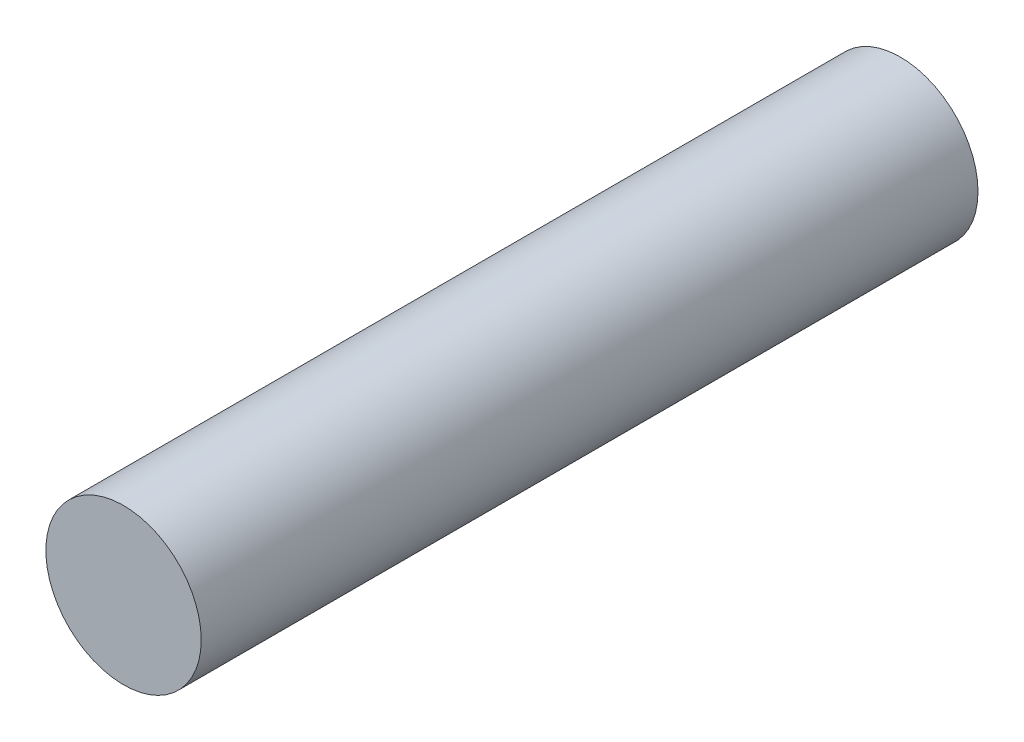
ISO-10303-21;
HEADER;
FILE_DESCRIPTION(('STEP AP214'),'2;1');
FILE_NAME('part.step','',(''),(''),'','','');
FILE_SCHEMA(('AUTOMOTIVE_DESIGN { 1 0 10303 214 1 1 1 1 }'));
ENDSEC;
DATA;
#1=APPLICATION_CONTEXT('core data for automotive mechanical design processes');
#2=APPLICATION_PROTOCOL_DEFINITION('international standard','automotive_design',2000,#1);
#3=PRODUCT_CONTEXT('',#1,'mechanical');
#4=PRODUCT('Part','Part','',(#3));
#5=PRODUCT_RELATED_PRODUCT_CATEGORY('part','',(#4));
#6=PRODUCT_DEFINITION_FORMATION('','',#4);
#7=PRODUCT_DEFINITION_CONTEXT('part definition',#1,'design');
#8=PRODUCT_DEFINITION('design','',#6,#7);
#9=PRODUCT_DEFINITION_SHAPE('','',#8);
#10=(LENGTH_UNIT() NAMED_UNIT(*) SI_UNIT(.MILLI.,.METRE.));
#11=(NAMED_UNIT(*) PLANE_ANGLE_UNIT() SI_UNIT($,.RADIAN.));
#12=(NAMED_UNIT(*) SI_UNIT($,.STERADIAN.) SOLID_ANGLE_UNIT());
#13=UNCERTAINTY_MEASURE_WITH_UNIT(LENGTH_MEASURE(1.E-05),#10,'distance_accuracy_value','');
#14=(GEOMETRIC_REPRESENTATION_CONTEXT(3) GLOBAL_UNCERTAINTY_ASSIGNED_CONTEXT((#13)) GLOBAL_UNIT_ASSIGNED_CONTEXT((#10,
#11,#12)) REPRESENTATION_CONTEXT('',''));
#15=CARTESIAN_POINT('',(0.,0.,0.));
#16=DIRECTION('',(0.,0.,1.));
#17=DIRECTION('',(1.,0.,0.));
#18=AXIS2_PLACEMENT_3D('',#15,#16,#17);
#19=CARTESIAN_POINT('',(-16.0295500711367,18.9227879799666,35.));
#20=DIRECTION('',(0.,0.,-1.));
#21=DIRECTION('',(-1.,0.,0.));
#22=AXIS2_PLACEMENT_3D('',#19,#20,#21);
#23=CYLINDRICAL_SURFACE('',#22,3.5);
#24=CARTESIAN_POINT('',(-16.0295500711367,18.9227879799666,35.));
#25=DIRECTION('',(0.,0.,1.));
#26=DIRECTION('',(1.,0.,0.));
#27=AXIS2_PLACEMENT_3D('',#24,#25,#26);
#28=CIRCLE('',#27,3.5);
#29=CARTESIAN_POINT('',(-12.5295500711367,18.9227879799666,35.));
#30=VERTEX_POINT('',#29);
#31=EDGE_CURVE('E10',#30,#30,#28,.T.);
#32=ORIENTED_EDGE('',*,*,#31,.F.);
#33=EDGE_LOOP('',(#32));
#34=FACE_BOUND('',#33,.T.);
#35=CARTESIAN_POINT('',(-16.0295500711367,18.9227879799666,0.));
#36=DIRECTION('',(0.,0.,1.));
#37=DIRECTION('',(1.,0.,0.));
#38=AXIS2_PLACEMENT_3D('',#35,#36,#37);
#39=CIRCLE('',#38,3.5);
#40=CARTESIAN_POINT('',(-12.5295500711367,18.9227879799666,0.));
#41=VERTEX_POINT('',#40);
#42=EDGE_CURVE('E34',#41,#41,#39,.T.);
#43=ORIENTED_EDGE('',*,*,#42,.T.);
#44=EDGE_LOOP('',(#43));
#45=FACE_BOUND('',#44,.T.);
#46=ADVANCED_FACE('F31',(#34,#45),#23,.T.);
#47=CARTESIAN_POINT('',(-16.0295500711367,18.9227879799666,35.));
#48=DIRECTION('',(0.,0.,1.));
#49=DIRECTION('',(1.,0.,0.));
#50=AXIS2_PLACEMENT_3D('',#47,#48,#49);
#51=PLANE('',#50);
#52=ORIENTED_EDGE('',*,*,#31,.T.);
#53=EDGE_LOOP('',(#52));
#54=FACE_BOUND('',#53,.T.);
#55=ADVANCED_FACE('F46',(#54),#51,.T.);
#56=CARTESIAN_POINT('',(-16.0295500711367,18.9227879799666,0.));
#57=DIRECTION('',(0.,0.,1.));
#58=DIRECTION('',(1.,0.,0.));
#59=AXIS2_PLACEMENT_3D('',#56,#57,#58);
#60=PLANE('',#59);
#61=ORIENTED_EDGE('',*,*,#42,.F.);
#62=EDGE_LOOP('',(#61));
#63=FACE_BOUND('',#62,.T.);
#64=ADVANCED_FACE('F44',(#63),#60,.F.);
#65=CLOSED_SHELL('',(#46,#55,#64));
#66=MANIFOLD_SOLID_BREP('B2',#65);
#67=ADVANCED_BREP_SHAPE_REPRESENTATION('',(#18,#66),#14);
#68=SHAPE_DEFINITION_REPRESENTATION(#9,#67);
ENDSEC;
END-ISO-10303-21;
